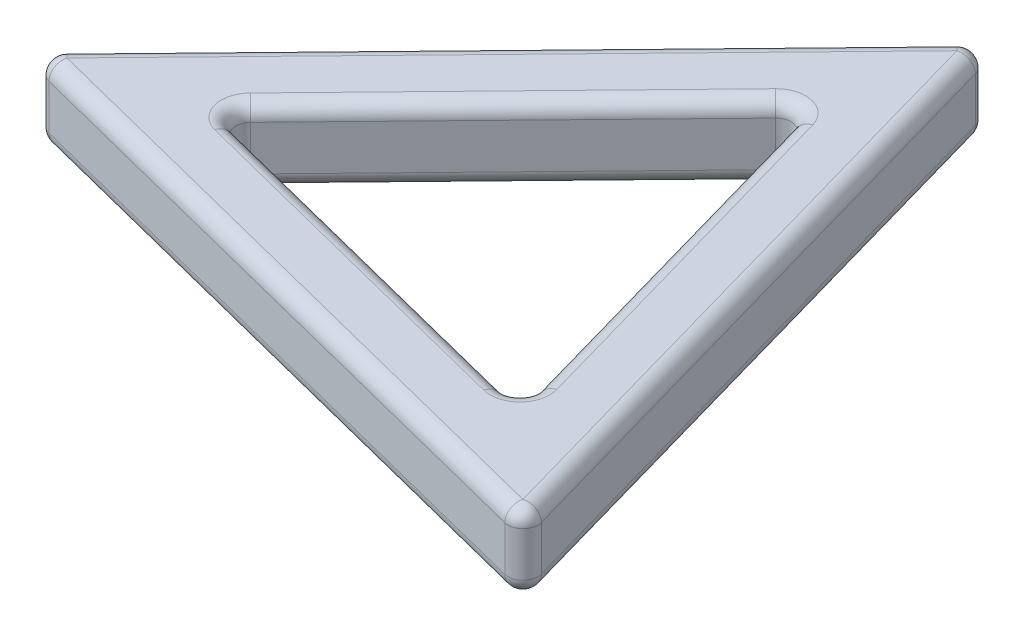
ISO-10303-21;
HEADER;
FILE_DESCRIPTION(('STEP AP214'),'2;1');
FILE_NAME('part.step','',(''),(''),'','','');
FILE_SCHEMA(('AUTOMOTIVE_DESIGN { 1 0 10303 214 1 1 1 1 }'));
ENDSEC;
DATA;
#1=APPLICATION_CONTEXT('core data for automotive mechanical design processes');
#2=APPLICATION_PROTOCOL_DEFINITION('international standard','automotive_design',2000,#1);
#3=PRODUCT_CONTEXT('',#1,'mechanical');
#4=PRODUCT('Part','Part','',(#3));
#5=PRODUCT_RELATED_PRODUCT_CATEGORY('part','',(#4));
#6=PRODUCT_DEFINITION_FORMATION('','',#4);
#7=PRODUCT_DEFINITION_CONTEXT('part definition',#1,'design');
#8=PRODUCT_DEFINITION('design','',#6,#7);
#9=PRODUCT_DEFINITION_SHAPE('','',#8);
#10=(LENGTH_UNIT() NAMED_UNIT(*) SI_UNIT(.MILLI.,.METRE.));
#11=(NAMED_UNIT(*) PLANE_ANGLE_UNIT() SI_UNIT($,.RADIAN.));
#12=(NAMED_UNIT(*) SI_UNIT($,.STERADIAN.) SOLID_ANGLE_UNIT());
#13=UNCERTAINTY_MEASURE_WITH_UNIT(LENGTH_MEASURE(1.E-05),#10,'distance_accuracy_value','');
#14=(GEOMETRIC_REPRESENTATION_CONTEXT(3) GLOBAL_UNCERTAINTY_ASSIGNED_CONTEXT((#13)) GLOBAL_UNIT_ASSIGNED_CONTEXT((#10,
#11,#12)) REPRESENTATION_CONTEXT('',''));
#15=CARTESIAN_POINT('',(0.,0.,0.));
#16=DIRECTION('',(0.,0.,1.));
#17=DIRECTION('',(1.,0.,0.));
#18=AXIS2_PLACEMENT_3D('',#15,#16,#17);
#19=CARTESIAN_POINT('',(37.8399876167163,10.,36.7800439859958));
#20=DIRECTION('',(0.,1.,0.));
#21=DIRECTION('',(0.,0.,1.));
#22=AXIS2_PLACEMENT_3D('',#19,#20,#21);
#23=PLANE('',#22);
#24=DIRECTION('',(-0.696992338556033,0.,0.717078573096556));
#25=VECTOR('',#24,1.);
#26=CARTESIAN_POINT('',(-49.3382891063465,10.,15.7743532390791));
#27=LINE('',#26,#25);
#28=CARTESIAN_POINT('',(11.9521634962858,10.,-47.2823948276063));
#29=VERTEX_POINT('',#28);
#30=CARTESIAN_POINT('',(-46.9238368206159,10.,13.2903201958346));
#31=VERTEX_POINT('',#30);
#32=EDGE_CURVE('E344',#29,#31,#27,.T.);
#33=ORIENTED_EDGE('',*,*,#32,.T.);
#34=DIRECTION('',(0.96950443008913,0.,0.24507378488437));
#35=VECTOR('',#34,1.);
#36=CARTESIAN_POINT('',(38.3301351864851,10.,34.8410351258175));
#37=LINE('',#36,#35);
#38=CARTESIAN_POINT('',(34.9716733243301,10.,33.9920746317716));
#39=VERTEX_POINT('',#38);
#40=EDGE_CURVE('E372',#31,#39,#37,.T.);
#41=ORIENTED_EDGE('',*,*,#40,.T.);
#42=DIRECTION('',(-0.272512091533098,0.,-0.962152357980926));
#43=VECTOR('',#42,1.);
#44=CARTESIAN_POINT('',(11.0081539198614,10.,-50.6153883648966));
#45=LINE('',#44,#43);
#46=EDGE_CURVE('E375',#39,#29,#45,.T.);
#47=ORIENTED_EDGE('',*,*,#46,.T.);
#48=EDGE_LOOP('',(#33,#41,#47));
#49=FACE_BOUND('',#48,.T.);
#50=CARTESIAN_POINT('',(20.630101862399,10.,20.052227860651));
#51=DIRECTION('',(0.,1.,0.));
#52=DIRECTION('',(0.,0.,1.));
#53=AXIS2_PLACEMENT_3D('',#50,#51,#52);
#54=CIRCLE('',#53,4.);
#55=CARTESIAN_POINT('',(19.6498067228615,10.,23.9302455810075));
#56=VERTEX_POINT('',#55);
#57=CARTESIAN_POINT('',(23.4984161547852,10.,22.8401972148751));
#58=VERTEX_POINT('',#57);
#59=EDGE_CURVE('E199',#56,#58,#54,.T.);
#60=ORIENTED_EDGE('',*,*,#59,.F.);
#61=DIRECTION('',(0.96950443008913,0.,0.24507378488437));
#62=VECTOR('',#61,1.);
#63=CARTESIAN_POINT('',(39.8005778957913,10.,29.0240085452827));
#64=LINE('',#63,#62);
#65=CARTESIAN_POINT('',(-28.6610848005348,10.,11.7180960855292));
#66=VERTEX_POINT('',#65);
#67=EDGE_CURVE('E215',#56,#66,#64,.F.);
#68=ORIENTED_EDGE('',*,*,#67,.T.);
#69=CARTESIAN_POINT('',(-27.6807896609974,10.,7.84007836517267));
#70=DIRECTION('',(0.,1.,0.));
#71=DIRECTION('',(0.,0.,1.));
#72=AXIS2_PLACEMENT_3D('',#69,#70,#71);
#73=CIRCLE('',#72,4.);
#74=CARTESIAN_POINT('',(-31.5293990929211,10.,8.93012673130507));
#75=VERTEX_POINT('',#74);
#76=EDGE_CURVE('E213',#75,#66,#73,.T.);
#77=ORIENTED_EDGE('',*,*,#76,.F.);
#78=CARTESIAN_POINT('',(-27.6807896609974,10.,7.84007836517267));
#79=DIRECTION('',(0.,1.,0.));
#80=DIRECTION('',(0.,0.,1.));
#81=AXIS2_PLACEMENT_3D('',#78,#79,#80);
#82=CIRCLE('',#81,4.);
#83=CARTESIAN_POINT('',(-30.5491039533836,10.,5.05210901094854));
#84=VERTEX_POINT('',#83);
#85=EDGE_CURVE('E206',#84,#75,#82,.T.);
#86=ORIENTED_EDGE('',*,*,#85,.F.);
#87=DIRECTION('',(-0.696992338556033,0.,0.717078573096556));
#88=VECTOR('',#87,1.);
#89=CARTESIAN_POINT('',(-13.1833652235857,10.,-12.8140832845497));
#90=LINE('',#89,#88);
#91=CARTESIAN_POINT('',(4.18237350621215,10.,-30.6802755800478));
#92=VERTEX_POINT('',#91);
#93=EDGE_CURVE('E385',#84,#92,#90,.F.);
#94=ORIENTED_EDGE('',*,*,#93,.T.);
#95=CARTESIAN_POINT('',(7.05068779859837,10.,-27.8923062258237));
#96=DIRECTION('',(0.,1.,0.));
#97=DIRECTION('',(0.,0.,1.));
#98=AXIS2_PLACEMENT_3D('',#95,#96,#97);
#99=CIRCLE('',#98,4.);
#100=CARTESIAN_POINT('',(8.03098293813586,10.,-31.7703239461802));
#101=VERTEX_POINT('',#100);
#102=EDGE_CURVE('E374',#101,#92,#99,.T.);
#103=ORIENTED_EDGE('',*,*,#102,.F.);
#104=CARTESIAN_POINT('',(7.05068779859837,10.,-27.8923062258237));
#105=DIRECTION('',(0.,1.,0.));
#106=DIRECTION('',(0.,0.,1.));
#107=AXIS2_PLACEMENT_3D('',#104,#105,#106);
#108=CIRCLE('',#107,4.);
#109=CARTESIAN_POINT('',(10.8992972305221,10.,-28.9823545919561));
#110=VERTEX_POINT('',#109);
#111=EDGE_CURVE('E378',#110,#101,#108,.T.);
#112=ORIENTED_EDGE('',*,*,#111,.F.);
#113=DIRECTION('',(-0.272512091533098,0.,-0.962152357980926));
#114=VECTOR('',#113,1.);
#115=CARTESIAN_POINT('',(30.1427687528689,10.,38.9601407182605));
#116=LINE('',#115,#114);
#117=CARTESIAN_POINT('',(24.4787112943227,10.,18.9621794945186));
#118=VERTEX_POINT('',#117);
#119=EDGE_CURVE('E202',#110,#118,#116,.F.);
#120=ORIENTED_EDGE('',*,*,#119,.T.);
#121=CARTESIAN_POINT('',(20.630101862399,10.,20.052227860651));
#122=DIRECTION('',(0.,1.,0.));
#123=DIRECTION('',(0.,0.,1.));
#124=AXIS2_PLACEMENT_3D('',#121,#122,#123);
#125=CIRCLE('',#124,4.);
#126=EDGE_CURVE('E196',#58,#118,#125,.T.);
#127=ORIENTED_EDGE('',*,*,#126,.F.);
#128=EDGE_LOOP('',(#60,#68,#77,#86,#94,#103,#112,#120,#127));
#129=FACE_BOUND('',#128,.T.);
#130=ADVANCED_FACE('F33',(#49,#129),#23,.T.);
#131=CARTESIAN_POINT('',(37.8399876167163,0.,36.7800439859958));
#132=DIRECTION('',(0.,1.,0.));
#133=DIRECTION('',(0.,0.,1.));
#134=AXIS2_PLACEMENT_3D('',#131,#132,#133);
#135=PLANE('',#134);
#136=DIRECTION('',(-0.272512091533098,0.,-0.962152357980926));
#137=VECTOR('',#136,1.);
#138=CARTESIAN_POINT('',(35.9156829007545,0.,37.325068169062));
#139=LINE('',#138,#137);
#140=CARTESIAN_POINT('',(11.9521634962858,0.,-47.2823948276063));
#141=VERTEX_POINT('',#140);
#142=CARTESIAN_POINT('',(34.9716733243301,0.,33.9920746317717));
#143=VERTEX_POINT('',#142);
#144=EDGE_CURVE('E463',#141,#143,#139,.F.);
#145=ORIENTED_EDGE('',*,*,#144,.T.);
#146=DIRECTION('',(0.96950443008913,0.,0.24507378488437));
#147=VECTOR('',#146,1.);
#148=CARTESIAN_POINT('',(38.3301351864851,0.,34.8410351258175));
#149=LINE('',#148,#147);
#150=CARTESIAN_POINT('',(-46.9238368206159,0.,13.2903201958346));
#151=VERTEX_POINT('',#150);
#152=EDGE_CURVE('E837',#143,#151,#149,.F.);
#153=ORIENTED_EDGE('',*,*,#152,.T.);
#154=DIRECTION('',(-0.696992338556033,0.,0.717078573096556));
#155=VECTOR('',#154,1.);
#156=CARTESIAN_POINT('',(-17.485836662165,0.,-16.9960373158859));
#157=LINE('',#156,#155);
#158=EDGE_CURVE('E290',#151,#141,#157,.F.);
#159=ORIENTED_EDGE('',*,*,#158,.T.);
#160=EDGE_LOOP('',(#145,#153,#159));
#161=FACE_BOUND('',#160,.T.);
#162=CARTESIAN_POINT('',(20.630101862399,0.,20.052227860651));
#163=DIRECTION('',(0.,1.,0.));
#164=DIRECTION('',(0.,0.,1.));
#165=AXIS2_PLACEMENT_3D('',#162,#163,#164);
#166=CIRCLE('',#165,4.);
#167=CARTESIAN_POINT('',(24.4787112943227,0.,18.9621794945186));
#168=VERTEX_POINT('',#167);
#169=CARTESIAN_POINT('',(23.4984161547852,0.,22.8401972148751));
#170=VERTEX_POINT('',#169);
#171=EDGE_CURVE('E420',#168,#170,#166,.F.);
#172=ORIENTED_EDGE('',*,*,#171,.F.);
#173=DIRECTION('',(-0.272512091533098,0.,-0.962152357980926));
#174=VECTOR('',#173,1.);
#175=CARTESIAN_POINT('',(9.95528765409771,0.,-32.3153481292464));
#176=LINE('',#175,#174);
#177=CARTESIAN_POINT('',(10.8992972305221,0.,-28.9823545919561));
#178=VERTEX_POINT('',#177);
#179=EDGE_CURVE('E809',#168,#178,#176,.T.);
#180=ORIENTED_EDGE('',*,*,#179,.T.);
#181=CARTESIAN_POINT('',(7.05068779859837,0.,-27.8923062258237));
#182=DIRECTION('',(0.,1.,0.));
#183=DIRECTION('',(0.,0.,1.));
#184=AXIS2_PLACEMENT_3D('',#181,#182,#183);
#185=CIRCLE('',#184,4.);
#186=CARTESIAN_POINT('',(8.03098293813586,0.,-31.7703239461802));
#187=VERTEX_POINT('',#186);
#188=EDGE_CURVE('E813',#187,#178,#185,.F.);
#189=ORIENTED_EDGE('',*,*,#188,.F.);
#190=CARTESIAN_POINT('',(7.05068779859837,0.,-27.8923062258237));
#191=DIRECTION('',(0.,1.,0.));
#192=DIRECTION('',(0.,0.,1.));
#193=AXIS2_PLACEMENT_3D('',#190,#191,#192);
#194=CIRCLE('',#193,4.);
#195=CARTESIAN_POINT('',(4.18237350621215,0.,-30.6802755800478));
#196=VERTEX_POINT('',#195);
#197=EDGE_CURVE('E814',#196,#187,#194,.F.);
#198=ORIENTED_EDGE('',*,*,#197,.F.);
#199=DIRECTION('',(-0.696992338556033,0.,0.717078573096556));
#200=VECTOR('',#199,1.);
#201=CARTESIAN_POINT('',(-32.9635562391142,0.,7.536142054193));
#202=LINE('',#201,#200);
#203=CARTESIAN_POINT('',(-30.5491039533836,0.,5.05210901094854));
#204=VERTEX_POINT('',#203);
#205=EDGE_CURVE('E819',#196,#204,#202,.T.);
#206=ORIENTED_EDGE('',*,*,#205,.T.);
#207=CARTESIAN_POINT('',(-27.6807896609974,0.,7.84007836517267));
#208=DIRECTION('',(0.,1.,0.));
#209=DIRECTION('',(0.,0.,1.));
#210=AXIS2_PLACEMENT_3D('',#207,#208,#209);
#211=CIRCLE('',#210,4.);
#212=CARTESIAN_POINT('',(-31.5293990929211,0.,8.93012673130507));
#213=VERTEX_POINT('',#212);
#214=EDGE_CURVE('E833',#213,#204,#211,.F.);
#215=ORIENTED_EDGE('',*,*,#214,.F.);
#216=CARTESIAN_POINT('',(-27.6807896609974,0.,7.84007836517267));
#217=DIRECTION('',(0.,1.,0.));
#218=DIRECTION('',(0.,0.,1.));
#219=AXIS2_PLACEMENT_3D('',#216,#217,#218);
#220=CIRCLE('',#219,4.);
#221=CARTESIAN_POINT('',(-28.6610848005348,0.,11.7180960855292));
#222=VERTEX_POINT('',#221);
#223=EDGE_CURVE('E812',#222,#213,#220,.F.);
#224=ORIENTED_EDGE('',*,*,#223,.F.);
#225=DIRECTION('',(0.96950443008913,0.,0.24507378488437));
#226=VECTOR('',#225,1.);
#227=CARTESIAN_POINT('',(23.0082685850165,0.,24.7792060750534));
#228=LINE('',#227,#226);
#229=CARTESIAN_POINT('',(19.6498067228615,0.,23.9302455810075));
#230=VERTEX_POINT('',#229);
#231=EDGE_CURVE('E810',#222,#230,#228,.T.);
#232=ORIENTED_EDGE('',*,*,#231,.T.);
#233=CARTESIAN_POINT('',(20.630101862399,0.,20.052227860651));
#234=DIRECTION('',(0.,1.,0.));
#235=DIRECTION('',(0.,0.,1.));
#236=AXIS2_PLACEMENT_3D('',#233,#234,#235);
#237=CIRCLE('',#236,4.);
#238=EDGE_CURVE('E425',#170,#230,#237,.F.);
#239=ORIENTED_EDGE('',*,*,#238,.F.);
#240=EDGE_LOOP('',(#172,#180,#189,#198,#206,#215,#224,#232,#239));
#241=FACE_BOUND('',#240,.T.);
#242=ADVANCED_FACE('F475',(#161,#241),#135,.F.);
#243=CARTESIAN_POINT('',(-50.7724462525396,10.,14.380368561967));
#244=DIRECTION('',(0.24507378488437,0.,-0.96950443008913));
#245=DIRECTION('',(-0.96950443008913,0.,-0.24507378488437));
#246=AXIS2_PLACEMENT_3D('',#243,#244,#245);
#247=PLANE('',#246);
#248=DIRECTION('',(0.96950443008913,0.,0.24507378488437));
#249=VECTOR('',#248,1.);
#250=CARTESIAN_POINT('',(-50.7724462525396,8.,14.380368561967));
#251=LINE('',#250,#249);
#252=CARTESIAN_POINT('',(34.4815257545614,8.,35.9310834919499));
#253=VERTEX_POINT('',#252);
#254=CARTESIAN_POINT('',(-47.4139843903846,8.,15.2293290560129));
#255=VERTEX_POINT('',#254);
#256=EDGE_CURVE('E222',#253,#255,#251,.F.);
#257=ORIENTED_EDGE('',*,*,#256,.T.);
#258=DIRECTION('',(0.,-1.,0.));
#259=VECTOR('',#258,1.);
#260=CARTESIAN_POINT('',(-47.4139843903846,10.,15.2293290560129));
#261=LINE('',#260,#259);
#262=CARTESIAN_POINT('',(-47.4139843903846,2.,15.2293290560129));
#263=VERTEX_POINT('',#262);
#264=EDGE_CURVE('E227',#255,#263,#261,.T.);
#265=ORIENTED_EDGE('',*,*,#264,.T.);
#266=DIRECTION('',(0.96950443008913,0.,0.24507378488437));
#267=VECTOR('',#266,1.);
#268=CARTESIAN_POINT('',(-50.7724462525396,2.,14.380368561967));
#269=LINE('',#268,#267);
#270=CARTESIAN_POINT('',(34.4815257545614,2.,35.9310834919499));
#271=VERTEX_POINT('',#270);
#272=EDGE_CURVE('E224',#263,#271,#269,.T.);
#273=ORIENTED_EDGE('',*,*,#272,.T.);
#274=DIRECTION('',(0.,-1.,0.));
#275=VECTOR('',#274,1.);
#276=CARTESIAN_POINT('',(34.4815257545614,10.,35.9310834919499));
#277=LINE('',#276,#275);
#278=EDGE_CURVE('E220',#271,#253,#277,.F.);
#279=ORIENTED_EDGE('',*,*,#278,.T.);
#280=EDGE_LOOP('',(#257,#265,#273,#279));
#281=FACE_BOUND('',#280,.T.);
#282=ADVANCED_FACE('F480',(#281),#247,.F.);
#283=CARTESIAN_POINT('',(37.8399876167163,10.,36.7800439859958));
#284=DIRECTION('',(-0.962152357980926,0.,0.272512091533098));
#285=DIRECTION('',(0.272512091533098,0.,0.962152357980926));
#286=AXIS2_PLACEMENT_3D('',#283,#284,#285);
#287=PLANE('',#286);
#288=DIRECTION('',(-0.272512091533098,0.,-0.962152357980926));
#289=VECTOR('',#288,1.);
#290=CARTESIAN_POINT('',(37.8399876167163,2.,36.7800439859958));
#291=LINE('',#290,#289);
#292=CARTESIAN_POINT('',(36.895978040292,2.,33.4470504487055));
#293=VERTEX_POINT('',#292);
#294=CARTESIAN_POINT('',(13.8764682122476,2.,-47.8274190106725));
#295=VERTEX_POINT('',#294);
#296=EDGE_CURVE('E233',#293,#295,#291,.T.);
#297=ORIENTED_EDGE('',*,*,#296,.T.);
#298=DIRECTION('',(0.,-1.,0.));
#299=VECTOR('',#298,1.);
#300=CARTESIAN_POINT('',(13.8764682122476,10.,-47.8274190106725));
#301=LINE('',#300,#299);
#302=CARTESIAN_POINT('',(13.8764682122476,8.,-47.8274190106725));
#303=VERTEX_POINT('',#302);
#304=EDGE_CURVE('E236',#295,#303,#301,.F.);
#305=ORIENTED_EDGE('',*,*,#304,.T.);
#306=DIRECTION('',(-0.272512091533098,0.,-0.962152357980926));
#307=VECTOR('',#306,1.);
#308=CARTESIAN_POINT('',(37.8399876167163,8.,36.7800439859958));
#309=LINE('',#308,#307);
#310=CARTESIAN_POINT('',(36.895978040292,8.,33.4470504487055));
#311=VERTEX_POINT('',#310);
#312=EDGE_CURVE('E231',#303,#311,#309,.F.);
#313=ORIENTED_EDGE('',*,*,#312,.T.);
#314=DIRECTION('',(0.,-1.,0.));
#315=VECTOR('',#314,1.);
#316=CARTESIAN_POINT('',(36.895978040292,10.,33.4470504487055));
#317=LINE('',#316,#315);
#318=EDGE_CURVE('E229',#311,#293,#317,.T.);
#319=ORIENTED_EDGE('',*,*,#318,.T.);
#320=EDGE_LOOP('',(#297,#305,#313,#319));
#321=FACE_BOUND('',#320,.T.);
#322=ADVANCED_FACE('F457',(#321),#287,.F.);
#323=CARTESIAN_POINT('',(12.9324586358233,10.,-51.1604125479628));
#324=DIRECTION('',(0.717078573096556,0.,0.696992338556033));
#325=DIRECTION('',(0.696992338556033,0.,-0.717078573096556));
#326=AXIS2_PLACEMENT_3D('',#323,#324,#325);
#327=PLANE('',#326);
#328=DIRECTION('',(-0.696992338556033,0.,0.717078573096556));
#329=VECTOR('',#328,1.);
#330=CARTESIAN_POINT('',(12.9324586358233,2.,-51.1604125479628));
#331=LINE('',#330,#329);
#332=CARTESIAN_POINT('',(10.5180063500927,2.,-48.6763795047183));
#333=VERTEX_POINT('',#332);
#334=CARTESIAN_POINT('',(-48.357993966809,2.,11.8963355187226));
#335=VERTEX_POINT('',#334);
#336=EDGE_CURVE('E42',#333,#335,#331,.T.);
#337=ORIENTED_EDGE('',*,*,#336,.T.);
#338=DIRECTION('',(0.,-1.,0.));
#339=VECTOR('',#338,1.);
#340=CARTESIAN_POINT('',(-48.357993966809,10.,11.8963355187226));
#341=LINE('',#340,#339);
#342=CARTESIAN_POINT('',(-48.357993966809,8.,11.8963355187226));
#343=VERTEX_POINT('',#342);
#344=EDGE_CURVE('E11',#335,#343,#341,.F.);
#345=ORIENTED_EDGE('',*,*,#344,.T.);
#346=DIRECTION('',(-0.696992338556033,0.,0.717078573096556));
#347=VECTOR('',#346,1.);
#348=CARTESIAN_POINT('',(12.9324586358233,8.,-51.1604125479628));
#349=LINE('',#348,#347);
#350=CARTESIAN_POINT('',(10.5180063500927,8.,-48.6763795047183));
#351=VERTEX_POINT('',#350);
#352=EDGE_CURVE('E240',#343,#351,#349,.F.);
#353=ORIENTED_EDGE('',*,*,#352,.T.);
#354=DIRECTION('',(0.,-1.,0.));
#355=VECTOR('',#354,1.);
#356=CARTESIAN_POINT('',(10.5180063500927,10.,-48.6763795047183));
#357=LINE('',#356,#355);
#358=EDGE_CURVE('E238',#351,#333,#357,.T.);
#359=ORIENTED_EDGE('',*,*,#358,.T.);
#360=EDGE_LOOP('',(#337,#345,#353,#359));
#361=FACE_BOUND('',#360,.T.);
#362=ADVANCED_FACE('F352',(#361),#327,.F.);
#363=CARTESIAN_POINT('',(-31.5293990929211,10.,8.93012673130507));
#364=DIRECTION('',(0.24507378488437,0.,-0.96950443008913));
#365=DIRECTION('',(-0.96950443008913,0.,-0.24507378488437));
#366=AXIS2_PLACEMENT_3D('',#363,#364,#365);
#367=PLANE('',#366);
#368=DIRECTION('',(0.96950443008913,0.,0.24507378488437));
#369=VECTOR('',#368,1.);
#370=CARTESIAN_POINT('',(-31.5293990929211,2.,8.93012673130507));
#371=LINE('',#370,#369);
#372=CARTESIAN_POINT('',(20.1399542926302,2.,21.9912367208293));
#373=VERTEX_POINT('',#372);
#374=CARTESIAN_POINT('',(-28.1709372307661,2.,9.77908722535094));
#375=VERTEX_POINT('',#374);
#376=EDGE_CURVE('E422',#373,#375,#371,.F.);
#377=ORIENTED_EDGE('',*,*,#376,.T.);
#378=DIRECTION('',(0.,-1.,0.));
#379=VECTOR('',#378,1.);
#380=CARTESIAN_POINT('',(-28.1709372307661,10.,9.77908722535094));
#381=LINE('',#380,#379);
#382=CARTESIAN_POINT('',(-28.1709372307661,8.,9.77908722535094));
#383=VERTEX_POINT('',#382);
#384=EDGE_CURVE('E430',#375,#383,#381,.F.);
#385=ORIENTED_EDGE('',*,*,#384,.T.);
#386=DIRECTION('',(0.96950443008913,0.,0.24507378488437));
#387=VECTOR('',#386,1.);
#388=CARTESIAN_POINT('',(-31.5293990929211,8.,8.93012673130507));
#389=LINE('',#388,#387);
#390=CARTESIAN_POINT('',(20.1399542926302,8.,21.9912367208293));
#391=VERTEX_POINT('',#390);
#392=EDGE_CURVE('E419',#383,#391,#389,.T.);
#393=ORIENTED_EDGE('',*,*,#392,.T.);
#394=DIRECTION('',(0.,-1.,0.));
#395=VECTOR('',#394,1.);
#396=CARTESIAN_POINT('',(20.1399542926302,0.,21.9912367208293));
#397=LINE('',#396,#395);
#398=EDGE_CURVE('E415',#391,#373,#397,.T.);
#399=ORIENTED_EDGE('',*,*,#398,.T.);
#400=EDGE_LOOP('',(#377,#385,#393,#399));
#401=FACE_BOUND('',#400,.T.);
#402=ADVANCED_FACE('F484',(#401),#367,.T.);
#403=CARTESIAN_POINT('',(23.4984161547852,10.,22.8401972148751));
#404=DIRECTION('',(-0.962152357980926,0.,0.272512091533098));
#405=DIRECTION('',(0.272512091533098,0.,0.962152357980926));
#406=AXIS2_PLACEMENT_3D('',#403,#404,#405);
#407=PLANE('',#406);
#408=DIRECTION('',(-0.272512091533098,0.,-0.962152357980926));
#409=VECTOR('',#408,1.);
#410=CARTESIAN_POINT('',(23.4984161547852,8.,22.8401972148751));
#411=LINE('',#410,#409);
#412=CARTESIAN_POINT('',(22.5544065783608,8.,19.5072036775848));
#413=VERTEX_POINT('',#412);
#414=CARTESIAN_POINT('',(8.97499251456023,8.,-28.4373304088899));
#415=VERTEX_POINT('',#414);
#416=EDGE_CURVE('E407',#413,#415,#411,.T.);
#417=ORIENTED_EDGE('',*,*,#416,.T.);
#418=DIRECTION('',(0.,-1.,0.));
#419=VECTOR('',#418,1.);
#420=CARTESIAN_POINT('',(8.97499251456023,0.,-28.4373304088899));
#421=LINE('',#420,#419);
#422=CARTESIAN_POINT('',(8.97499251456023,2.,-28.4373304088899));
#423=VERTEX_POINT('',#422);
#424=EDGE_CURVE('E436',#415,#423,#421,.T.);
#425=ORIENTED_EDGE('',*,*,#424,.T.);
#426=DIRECTION('',(-0.272512091533098,0.,-0.962152357980926));
#427=VECTOR('',#426,1.);
#428=CARTESIAN_POINT('',(23.4984161547852,2.,22.8401972148751));
#429=LINE('',#428,#427);
#430=CARTESIAN_POINT('',(22.5544065783608,2.,19.5072036775848));
#431=VERTEX_POINT('',#430);
#432=EDGE_CURVE('E434',#423,#431,#429,.F.);
#433=ORIENTED_EDGE('',*,*,#432,.T.);
#434=DIRECTION('',(0.,-1.,0.));
#435=VECTOR('',#434,1.);
#436=CARTESIAN_POINT('',(22.5544065783608,10.,19.5072036775848));
#437=LINE('',#436,#435);
#438=EDGE_CURVE('E413',#431,#413,#437,.F.);
#439=ORIENTED_EDGE('',*,*,#438,.T.);
#440=EDGE_LOOP('',(#417,#425,#433,#439));
#441=FACE_BOUND('',#440,.T.);
#442=ADVANCED_FACE('F741',(#441),#407,.T.);
#443=CARTESIAN_POINT('',(8.03098293813586,10.,-31.7703239461802));
#444=DIRECTION('',(0.717078573096556,0.,0.696992338556033));
#445=DIRECTION('',(0.696992338556033,0.,-0.717078573096556));
#446=AXIS2_PLACEMENT_3D('',#443,#444,#445);
#447=PLANE('',#446);
#448=DIRECTION('',(-0.696992338556033,0.,0.717078573096556));
#449=VECTOR('',#448,1.);
#450=CARTESIAN_POINT('',(8.03098293813586,8.,-31.7703239461802));
#451=LINE('',#450,#449);
#452=CARTESIAN_POINT('',(5.61653065240526,8.,-29.2862909029358));
#453=VERTEX_POINT('',#452);
#454=CARTESIAN_POINT('',(-29.1149468071905,8.,6.44609368806061));
#455=VERTEX_POINT('',#454);
#456=EDGE_CURVE('E398',#453,#455,#451,.T.);
#457=ORIENTED_EDGE('',*,*,#456,.T.);
#458=DIRECTION('',(0.,-1.,0.));
#459=VECTOR('',#458,1.);
#460=CARTESIAN_POINT('',(-29.1149468071905,0.,6.44609368806061));
#461=LINE('',#460,#459);
#462=CARTESIAN_POINT('',(-29.1149468071905,2.,6.44609368806061));
#463=VERTEX_POINT('',#462);
#464=EDGE_CURVE('E444',#455,#463,#461,.T.);
#465=ORIENTED_EDGE('',*,*,#464,.T.);
#466=DIRECTION('',(-0.696992338556033,0.,0.717078573096556));
#467=VECTOR('',#466,1.);
#468=CARTESIAN_POINT('',(8.03098293813586,2.,-31.7703239461802));
#469=LINE('',#468,#467);
#470=CARTESIAN_POINT('',(5.61653065240526,2.,-29.2862909029358));
#471=VERTEX_POINT('',#470);
#472=EDGE_CURVE('E441',#463,#471,#469,.F.);
#473=ORIENTED_EDGE('',*,*,#472,.T.);
#474=DIRECTION('',(0.,-1.,0.));
#475=VECTOR('',#474,1.);
#476=CARTESIAN_POINT('',(5.61653065240526,10.,-29.2862909029358));
#477=LINE('',#476,#475);
#478=EDGE_CURVE('E438',#471,#453,#477,.F.);
#479=ORIENTED_EDGE('',*,*,#478,.T.);
#480=EDGE_LOOP('',(#457,#465,#473,#479));
#481=FACE_BOUND('',#480,.T.);
#482=ADVANCED_FACE('F542',(#481),#447,.T.);
#483=CARTESIAN_POINT('',(7.05068779859837,8.,-27.8923062258237));
#484=DIRECTION('',(0.,1.,0.));
#485=DIRECTION('',(0.,0.,1.));
#486=AXIS2_PLACEMENT_3D('',#483,#484,#485);
#487=TOROIDAL_SURFACE('',#486,4.,2.);
#488=ORIENTED_EDGE('',*,*,#111,.T.);
#489=ORIENTED_EDGE('',*,*,#102,.T.);
#490=CARTESIAN_POINT('',(4.18237350621215,8.,-30.6802755800478));
#491=DIRECTION('',(0.696992338556032,0.,-0.717078573096556));
#492=DIRECTION('',(-0.717078573096556,0.,-0.696992338556032));
#493=AXIS2_PLACEMENT_3D('',#490,#491,#492);
#494=CIRCLE('',#493,2.);
#495=EDGE_CURVE('E287',#453,#92,#494,.F.);
#496=ORIENTED_EDGE('',*,*,#495,.F.);
#497=CARTESIAN_POINT('',(7.05068779859837,8.,-27.8923062258237));
#498=DIRECTION('',(0.,1.,0.));
#499=DIRECTION('',(0.,0.,1.));
#500=AXIS2_PLACEMENT_3D('',#497,#498,#499);
#501=CIRCLE('',#500,2.);
#502=EDGE_CURVE('E284',#415,#453,#501,.T.);
#503=ORIENTED_EDGE('',*,*,#502,.F.);
#504=CARTESIAN_POINT('',(10.8992972305221,8.,-28.9823545919561));
#505=DIRECTION('',(-0.272512091533098,0.,-0.962152357980926));
#506=DIRECTION('',(-0.962152357980926,0.,0.272512091533098));
#507=AXIS2_PLACEMENT_3D('',#504,#505,#506);
#508=CIRCLE('',#507,2.);
#509=EDGE_CURVE('E281',#110,#415,#508,.F.);
#510=ORIENTED_EDGE('',*,*,#509,.F.);
#511=EDGE_LOOP('',(#488,#489,#496,#503,#510));
#512=FACE_BOUND('',#511,.T.);
#513=ADVANCED_FACE('F401',(#512),#487,.T.);
#514=CARTESIAN_POINT('',(6.59682579194274,8.,-33.1643086232923));
#515=DIRECTION('',(-0.696992338556033,0.,0.717078573096556));
#516=DIRECTION('',(0.717078573096556,0.,0.696992338556033));
#517=AXIS2_PLACEMENT_3D('',#514,#515,#516);
#518=CYLINDRICAL_SURFACE('',#517,2.);
#519=ORIENTED_EDGE('',*,*,#495,.T.);
#520=ORIENTED_EDGE('',*,*,#93,.F.);
#521=CARTESIAN_POINT('',(-30.5491039533836,8.,5.05210901094854));
#522=DIRECTION('',(-0.696992338556033,0.,0.717078573096556));
#523=DIRECTION('',(0.717078573096556,0.,0.696992338556033));
#524=AXIS2_PLACEMENT_3D('',#521,#522,#523);
#525=CIRCLE('',#524,2.);
#526=EDGE_CURVE('E275',#455,#84,#525,.T.);
#527=ORIENTED_EDGE('',*,*,#526,.F.);
#528=ORIENTED_EDGE('',*,*,#456,.F.);
#529=EDGE_LOOP('',(#519,#520,#527,#528));
#530=FACE_BOUND('',#529,.T.);
#531=ADVANCED_FACE('F395',(#530),#518,.T.);
#532=CARTESIAN_POINT('',(7.05068779859837,10.,-27.8923062258237));
#533=DIRECTION('',(0.,1.,0.));
#534=DIRECTION('',(0.,0.,1.));
#535=AXIS2_PLACEMENT_3D('',#532,#533,#534);
#536=CYLINDRICAL_SURFACE('',#535,2.);
#537=ORIENTED_EDGE('',*,*,#502,.T.);
#538=ORIENTED_EDGE('',*,*,#478,.F.);
#539=CARTESIAN_POINT('',(7.05068779859837,2.,-27.8923062258237));
#540=DIRECTION('',(0.,1.,0.));
#541=DIRECTION('',(0.,0.,1.));
#542=AXIS2_PLACEMENT_3D('',#539,#540,#541);
#543=CIRCLE('',#542,2.);
#544=EDGE_CURVE('E272',#423,#471,#543,.T.);
#545=ORIENTED_EDGE('',*,*,#544,.F.);
#546=ORIENTED_EDGE('',*,*,#424,.F.);
#547=EDGE_LOOP('',(#537,#538,#545,#546));
#548=FACE_BOUND('',#547,.T.);
#549=ADVANCED_FACE('F534',(#548),#536,.F.);
#550=CARTESIAN_POINT('',(25.4227208707471,8.,22.2951730318089));
#551=DIRECTION('',(-0.272512091533098,0.,-0.962152357980926));
#552=DIRECTION('',(-0.962152357980926,0.,0.272512091533098));
#553=AXIS2_PLACEMENT_3D('',#550,#551,#552);
#554=CYLINDRICAL_SURFACE('',#553,2.);
#555=ORIENTED_EDGE('',*,*,#509,.T.);
#556=ORIENTED_EDGE('',*,*,#416,.F.);
#557=CARTESIAN_POINT('',(24.4787112943227,8.,18.9621794945186));
#558=DIRECTION('',(0.272512091533098,0.,0.962152357980926));
#559=DIRECTION('',(0.962152357980926,0.,-0.272512091533098));
#560=AXIS2_PLACEMENT_3D('',#557,#558,#559);
#561=CIRCLE('',#560,2.);
#562=EDGE_CURVE('E270',#118,#413,#561,.T.);
#563=ORIENTED_EDGE('',*,*,#562,.F.);
#564=ORIENTED_EDGE('',*,*,#119,.F.);
#565=EDGE_LOOP('',(#555,#556,#563,#564));
#566=FACE_BOUND('',#565,.T.);
#567=ADVANCED_FACE('F406',(#566),#554,.T.);
#568=CARTESIAN_POINT('',(-32.0195466626898,8.,10.8691355914833));
#569=DIRECTION('',(0.96950443008913,0.,0.24507378488437));
#570=DIRECTION('',(0.24507378488437,0.,-0.96950443008913));
#571=AXIS2_PLACEMENT_3D('',#568,#569,#570);
#572=CYLINDRICAL_SURFACE('',#571,2.);
#573=CARTESIAN_POINT('',(-28.6610848005348,8.,11.7180960855292));
#574=DIRECTION('',(-0.969504430089131,0.,-0.245073784884369));
#575=DIRECTION('',(-0.245073784884369,0.,0.969504430089131));
#576=AXIS2_PLACEMENT_3D('',#573,#574,#575);
#577=CIRCLE('',#576,2.);
#578=EDGE_CURVE('E278',#66,#383,#577,.T.);
#579=ORIENTED_EDGE('',*,*,#578,.F.);
#580=ORIENTED_EDGE('',*,*,#67,.F.);
#581=CARTESIAN_POINT('',(19.6498067228615,8.,23.9302455810075));
#582=DIRECTION('',(0.96950443008913,0.,0.245073784884369));
#583=DIRECTION('',(0.24507378488437,0.,-0.969504430089131));
#584=AXIS2_PLACEMENT_3D('',#581,#582,#583);
#585=CIRCLE('',#584,2.);
#586=EDGE_CURVE('E212',#391,#56,#585,.T.);
#587=ORIENTED_EDGE('',*,*,#586,.F.);
#588=ORIENTED_EDGE('',*,*,#392,.F.);
#589=EDGE_LOOP('',(#579,#580,#587,#588));
#590=FACE_BOUND('',#589,.T.);
#591=ADVANCED_FACE('F528',(#590),#572,.T.);
#592=CARTESIAN_POINT('',(-27.6807896609974,8.,7.84007836517267));
#593=DIRECTION('',(0.,1.,0.));
#594=DIRECTION('',(0.,0.,1.));
#595=AXIS2_PLACEMENT_3D('',#592,#593,#594);
#596=TOROIDAL_SURFACE('',#595,4.,2.);
#597=ORIENTED_EDGE('',*,*,#76,.T.);
#598=ORIENTED_EDGE('',*,*,#578,.T.);
#599=CARTESIAN_POINT('',(-27.6807896609974,8.,7.84007836517267));
#600=DIRECTION('',(0.,1.,0.));
#601=DIRECTION('',(0.,0.,1.));
#602=AXIS2_PLACEMENT_3D('',#599,#600,#601);
#603=CIRCLE('',#602,2.);
#604=EDGE_CURVE('E266',#455,#383,#603,.T.);
#605=ORIENTED_EDGE('',*,*,#604,.F.);
#606=ORIENTED_EDGE('',*,*,#526,.T.);
#607=ORIENTED_EDGE('',*,*,#85,.T.);
#608=EDGE_LOOP('',(#597,#598,#605,#606,#607));
#609=FACE_BOUND('',#608,.T.);
#610=ADVANCED_FACE('F389',(#609),#596,.T.);
#611=CARTESIAN_POINT('',(7.05068779859837,2.,-27.8923062258237));
#612=DIRECTION('',(0.,1.,0.));
#613=DIRECTION('',(0.,0.,1.));
#614=AXIS2_PLACEMENT_3D('',#611,#612,#613);
#615=TOROIDAL_SURFACE('',#614,4.,2.);
#616=CARTESIAN_POINT('',(10.8992972305221,2.,-28.9823545919561));
#617=DIRECTION('',(-0.272512091533098,0.,-0.962152357980926));
#618=DIRECTION('',(-0.962152357980926,0.,0.272512091533098));
#619=AXIS2_PLACEMENT_3D('',#616,#617,#618);
#620=CIRCLE('',#619,2.);
#621=EDGE_CURVE('E261',#423,#178,#620,.F.);
#622=ORIENTED_EDGE('',*,*,#621,.F.);
#623=ORIENTED_EDGE('',*,*,#544,.T.);
#624=CARTESIAN_POINT('',(4.18237350621215,2.,-30.6802755800478));
#625=DIRECTION('',(0.696992338556033,0.,-0.717078573096556));
#626=DIRECTION('',(-0.717078573096556,0.,-0.696992338556033));
#627=AXIS2_PLACEMENT_3D('',#624,#625,#626);
#628=CIRCLE('',#627,2.);
#629=EDGE_CURVE('E264',#196,#471,#628,.F.);
#630=ORIENTED_EDGE('',*,*,#629,.F.);
#631=ORIENTED_EDGE('',*,*,#197,.T.);
#632=ORIENTED_EDGE('',*,*,#188,.T.);
#633=EDGE_LOOP('',(#622,#623,#630,#631,#632));
#634=FACE_BOUND('',#633,.T.);
#635=ADVANCED_FACE('F522',(#634),#615,.T.);
#636=CARTESIAN_POINT('',(20.630101862399,8.,20.052227860651));
#637=DIRECTION('',(0.,1.,0.));
#638=DIRECTION('',(0.,0.,1.));
#639=AXIS2_PLACEMENT_3D('',#636,#637,#638);
#640=TOROIDAL_SURFACE('',#639,4.,2.);
#641=ORIENTED_EDGE('',*,*,#126,.T.);
#642=ORIENTED_EDGE('',*,*,#562,.T.);
#643=CARTESIAN_POINT('',(20.630101862399,8.,20.052227860651));
#644=DIRECTION('',(0.,1.,0.));
#645=DIRECTION('',(0.,0.,1.));
#646=AXIS2_PLACEMENT_3D('',#643,#644,#645);
#647=CIRCLE('',#646,2.);
#648=EDGE_CURVE('E258',#391,#413,#647,.T.);
#649=ORIENTED_EDGE('',*,*,#648,.F.);
#650=ORIENTED_EDGE('',*,*,#586,.T.);
#651=ORIENTED_EDGE('',*,*,#59,.T.);
#652=EDGE_LOOP('',(#641,#642,#649,#650,#651));
#653=FACE_BOUND('',#652,.T.);
#654=ADVANCED_FACE('F209',(#653),#640,.T.);
#655=CARTESIAN_POINT('',(-27.6807896609974,10.,7.84007836517267));
#656=DIRECTION('',(0.,1.,0.));
#657=DIRECTION('',(0.,0.,1.));
#658=AXIS2_PLACEMENT_3D('',#655,#656,#657);
#659=CYLINDRICAL_SURFACE('',#658,2.);
#660=ORIENTED_EDGE('',*,*,#604,.T.);
#661=ORIENTED_EDGE('',*,*,#384,.F.);
#662=CARTESIAN_POINT('',(-27.6807896609974,2.,7.84007836517267));
#663=DIRECTION('',(0.,1.,0.));
#664=DIRECTION('',(0.,0.,1.));
#665=AXIS2_PLACEMENT_3D('',#662,#663,#664);
#666=CIRCLE('',#665,2.);
#667=EDGE_CURVE('E255',#463,#375,#666,.T.);
#668=ORIENTED_EDGE('',*,*,#667,.F.);
#669=ORIENTED_EDGE('',*,*,#464,.F.);
#670=EDGE_LOOP('',(#660,#661,#668,#669));
#671=FACE_BOUND('',#670,.T.);
#672=ADVANCED_FACE('F515',(#671),#659,.F.);
#673=CARTESIAN_POINT('',(-13.1833652235857,2.,-12.8140832845497));
#674=DIRECTION('',(0.696992338556033,0.,-0.717078573096556));
#675=DIRECTION('',(-0.717078573096556,0.,-0.696992338556033));
#676=AXIS2_PLACEMENT_3D('',#673,#674,#675);
#677=CYLINDRICAL_SURFACE('',#676,2.);
#678=ORIENTED_EDGE('',*,*,#629,.T.);
#679=ORIENTED_EDGE('',*,*,#472,.F.);
#680=CARTESIAN_POINT('',(-30.5491039533836,2.,5.05210901094854));
#681=DIRECTION('',(-0.696992338556033,0.,0.717078573096556));
#682=DIRECTION('',(0.717078573096556,0.,0.696992338556033));
#683=AXIS2_PLACEMENT_3D('',#680,#681,#682);
#684=CIRCLE('',#683,2.);
#685=EDGE_CURVE('E252',#204,#463,#684,.T.);
#686=ORIENTED_EDGE('',*,*,#685,.F.);
#687=ORIENTED_EDGE('',*,*,#205,.F.);
#688=EDGE_LOOP('',(#678,#679,#686,#687));
#689=FACE_BOUND('',#688,.T.);
#690=ADVANCED_FACE('F511',(#689),#677,.T.);
#691=CARTESIAN_POINT('',(30.1427687528689,2.,38.9601407182605));
#692=DIRECTION('',(0.272512091533098,0.,0.962152357980926));
#693=DIRECTION('',(0.962152357980926,0.,-0.272512091533098));
#694=AXIS2_PLACEMENT_3D('',#691,#692,#693);
#695=CYLINDRICAL_SURFACE('',#694,2.);
#696=ORIENTED_EDGE('',*,*,#621,.T.);
#697=ORIENTED_EDGE('',*,*,#179,.F.);
#698=CARTESIAN_POINT('',(24.4787112943227,2.,18.9621794945186));
#699=DIRECTION('',(0.272512091533098,0.,0.962152357980926));
#700=DIRECTION('',(0.962152357980926,0.,-0.272512091533098));
#701=AXIS2_PLACEMENT_3D('',#698,#699,#700);
#702=CIRCLE('',#701,2.);
#703=EDGE_CURVE('E249',#431,#168,#702,.T.);
#704=ORIENTED_EDGE('',*,*,#703,.F.);
#705=ORIENTED_EDGE('',*,*,#432,.F.);
#706=EDGE_LOOP('',(#696,#697,#704,#705));
#707=FACE_BOUND('',#706,.T.);
#708=ADVANCED_FACE('F508',(#707),#695,.T.);
#709=CARTESIAN_POINT('',(20.630101862399,10.,20.052227860651));
#710=DIRECTION('',(0.,1.,0.));
#711=DIRECTION('',(0.,0.,1.));
#712=AXIS2_PLACEMENT_3D('',#709,#710,#711);
#713=CYLINDRICAL_SURFACE('',#712,2.);
#714=ORIENTED_EDGE('',*,*,#648,.T.);
#715=ORIENTED_EDGE('',*,*,#438,.F.);
#716=CARTESIAN_POINT('',(20.630101862399,2.,20.052227860651));
#717=DIRECTION('',(0.,1.,0.));
#718=DIRECTION('',(0.,0.,1.));
#719=AXIS2_PLACEMENT_3D('',#716,#717,#718);
#720=CIRCLE('',#719,2.);
#721=EDGE_CURVE('E247',#373,#431,#720,.T.);
#722=ORIENTED_EDGE('',*,*,#721,.F.);
#723=ORIENTED_EDGE('',*,*,#398,.F.);
#724=EDGE_LOOP('',(#714,#715,#722,#723));
#725=FACE_BOUND('',#724,.T.);
#726=ADVANCED_FACE('F411',(#725),#713,.F.);
#727=CARTESIAN_POINT('',(-27.6807896609974,2.,7.84007836517267));
#728=DIRECTION('',(0.,1.,0.));
#729=DIRECTION('',(0.,0.,1.));
#730=AXIS2_PLACEMENT_3D('',#727,#728,#729);
#731=TOROIDAL_SURFACE('',#730,4.,2.);
#732=ORIENTED_EDGE('',*,*,#685,.T.);
#733=ORIENTED_EDGE('',*,*,#667,.T.);
#734=CARTESIAN_POINT('',(-28.6610848005348,2.,11.7180960855292));
#735=DIRECTION('',(-0.96950443008913,0.,-0.245073784884369));
#736=DIRECTION('',(-0.24507378488437,0.,0.969504430089131));
#737=AXIS2_PLACEMENT_3D('',#734,#735,#736);
#738=CIRCLE('',#737,2.);
#739=EDGE_CURVE('E245',#222,#375,#738,.F.);
#740=ORIENTED_EDGE('',*,*,#739,.F.);
#741=ORIENTED_EDGE('',*,*,#223,.T.);
#742=ORIENTED_EDGE('',*,*,#214,.T.);
#743=EDGE_LOOP('',(#732,#733,#740,#741,#742));
#744=FACE_BOUND('',#743,.T.);
#745=ADVANCED_FACE('F501',(#744),#731,.T.);
#746=CARTESIAN_POINT('',(20.630101862399,2.,20.052227860651));
#747=DIRECTION('',(0.,1.,0.));
#748=DIRECTION('',(0.,0.,1.));
#749=AXIS2_PLACEMENT_3D('',#746,#747,#748);
#750=TOROIDAL_SURFACE('',#749,4.,2.);
#751=ORIENTED_EDGE('',*,*,#171,.T.);
#752=ORIENTED_EDGE('',*,*,#238,.T.);
#753=CARTESIAN_POINT('',(19.6498067228615,2.,23.9302455810075));
#754=DIRECTION('',(0.969504430089131,0.,0.245073784884369));
#755=DIRECTION('',(0.245073784884369,0.,-0.969504430089131));
#756=AXIS2_PLACEMENT_3D('',#753,#754,#755);
#757=CIRCLE('',#756,2.);
#758=EDGE_CURVE('E243',#373,#230,#757,.F.);
#759=ORIENTED_EDGE('',*,*,#758,.F.);
#760=ORIENTED_EDGE('',*,*,#721,.T.);
#761=ORIENTED_EDGE('',*,*,#703,.T.);
#762=EDGE_LOOP('',(#751,#752,#759,#760,#761));
#763=FACE_BOUND('',#762,.T.);
#764=ADVANCED_FACE('F497',(#763),#750,.T.);
#765=CARTESIAN_POINT('',(39.8005778957913,2.,29.0240085452827));
#766=DIRECTION('',(-0.96950443008913,0.,-0.24507378488437));
#767=DIRECTION('',(-0.24507378488437,0.,0.96950443008913));
#768=AXIS2_PLACEMENT_3D('',#765,#766,#767);
#769=CYLINDRICAL_SURFACE('',#768,2.);
#770=ORIENTED_EDGE('',*,*,#739,.T.);
#771=ORIENTED_EDGE('',*,*,#376,.F.);
#772=ORIENTED_EDGE('',*,*,#758,.T.);
#773=ORIENTED_EDGE('',*,*,#231,.F.);
#774=EDGE_LOOP('',(#770,#771,#772,#773));
#775=FACE_BOUND('',#774,.T.);
#776=ADVANCED_FACE('F494',(#775),#769,.T.);
#777=CARTESIAN_POINT('',(11.9521634962858,8.,-47.2823948276063));
#778=DIRECTION('',(0.,0.,1.));
#779=DIRECTION('',(1.,0.,0.));
#780=AXIS2_PLACEMENT_3D('',#777,#778,#779);
#781=SPHERICAL_SURFACE('',#780,2.);
#782=CARTESIAN_POINT('',(11.9521634962858,8.,-47.2823948276063));
#783=DIRECTION('',(0.,1.,0.));
#784=DIRECTION('',(0.,0.,1.));
#785=AXIS2_PLACEMENT_3D('',#782,#783,#784);
#786=CIRCLE('',#785,2.);
#787=EDGE_CURVE('E329',#351,#303,#786,.F.);
#788=ORIENTED_EDGE('',*,*,#787,.F.);
#789=CARTESIAN_POINT('',(11.9521634962858,8.,-47.2823948276063));
#790=DIRECTION('',(0.696992338556034,0.,-0.717078573096555));
#791=DIRECTION('',(-0.717078573096555,0.,-0.696992338556034));
#792=AXIS2_PLACEMENT_3D('',#789,#790,#791);
#793=CIRCLE('',#792,2.);
#794=EDGE_CURVE('E37',#29,#351,#793,.F.);
#795=ORIENTED_EDGE('',*,*,#794,.F.);
#796=CARTESIAN_POINT('',(11.9521634962858,8.,-47.2823948276063));
#797=DIRECTION('',(-0.272512091533096,0.,-0.962152357980927));
#798=DIRECTION('',(-0.962152357980927,0.,0.272512091533096));
#799=AXIS2_PLACEMENT_3D('',#796,#797,#798);
#800=CIRCLE('',#799,2.);
#801=EDGE_CURVE('E331',#303,#29,#800,.F.);
#802=ORIENTED_EDGE('',*,*,#801,.F.);
#803=EDGE_LOOP('',(#788,#795,#802));
#804=FACE_BOUND('',#803,.T.);
#805=ADVANCED_FACE('F35',(#804),#781,.T.);
#806=CARTESIAN_POINT('',(-17.485836662165,8.,-16.9960373158859));
#807=DIRECTION('',(0.696992338556033,0.,-0.717078573096556));
#808=DIRECTION('',(-0.717078573096556,0.,-0.696992338556033));
#809=AXIS2_PLACEMENT_3D('',#806,#807,#808);
#810=CYLINDRICAL_SURFACE('',#809,2.);
#811=ORIENTED_EDGE('',*,*,#794,.T.);
#812=ORIENTED_EDGE('',*,*,#352,.F.);
#813=CARTESIAN_POINT('',(-46.9238368206159,8.,13.2903201958346));
#814=DIRECTION('',(-0.696992338556033,0.,0.717078573096555));
#815=DIRECTION('',(0.717078573096556,0.,0.696992338556033));
#816=AXIS2_PLACEMENT_3D('',#813,#814,#815);
#817=CIRCLE('',#816,2.);
#818=EDGE_CURVE('E326',#31,#343,#817,.T.);
#819=ORIENTED_EDGE('',*,*,#818,.F.);
#820=ORIENTED_EDGE('',*,*,#32,.F.);
#821=EDGE_LOOP('',(#811,#812,#819,#820));
#822=FACE_BOUND('',#821,.T.);
#823=ADVANCED_FACE('F342',(#822),#810,.T.);
#824=CARTESIAN_POINT('',(38.3301351864851,8.,34.8410351258175));
#825=DIRECTION('',(-0.96950443008913,0.,-0.24507378488437));
#826=DIRECTION('',(-0.24507378488437,0.,0.96950443008913));
#827=AXIS2_PLACEMENT_3D('',#824,#825,#826);
#828=CYLINDRICAL_SURFACE('',#827,2.);
#829=CARTESIAN_POINT('',(34.9716733243301,8.,33.9920746317716));
#830=DIRECTION('',(0.969504430089131,0.,0.245073784884367));
#831=DIRECTION('',(0.245073784884367,0.,-0.969504430089131));
#832=AXIS2_PLACEMENT_3D('',#829,#830,#831);
#833=CIRCLE('',#832,2.);
#834=EDGE_CURVE('E320',#39,#253,#833,.T.);
#835=ORIENTED_EDGE('',*,*,#834,.F.);
#836=ORIENTED_EDGE('',*,*,#40,.F.);
#837=CARTESIAN_POINT('',(-46.9238368206159,8.,13.2903201958346));
#838=DIRECTION('',(-0.96950443008913,0.,-0.245073784884371));
#839=DIRECTION('',(-0.245073784884371,0.,0.96950443008913));
#840=AXIS2_PLACEMENT_3D('',#837,#838,#839);
#841=CIRCLE('',#840,2.);
#842=EDGE_CURVE('E323',#255,#31,#841,.T.);
#843=ORIENTED_EDGE('',*,*,#842,.F.);
#844=ORIENTED_EDGE('',*,*,#256,.F.);
#845=EDGE_LOOP('',(#835,#836,#843,#844));
#846=FACE_BOUND('',#845,.T.);
#847=ADVANCED_FACE('F370',(#846),#828,.T.);
#848=CARTESIAN_POINT('',(35.9156829007545,8.,37.325068169062));
#849=DIRECTION('',(0.272512091533098,0.,0.962152357980926));
#850=DIRECTION('',(0.962152357980926,0.,-0.272512091533098));
#851=AXIS2_PLACEMENT_3D('',#848,#849,#850);
#852=CYLINDRICAL_SURFACE('',#851,2.);
#853=ORIENTED_EDGE('',*,*,#801,.T.);
#854=ORIENTED_EDGE('',*,*,#46,.F.);
#855=CARTESIAN_POINT('',(34.9716733243301,8.,33.9920746317717));
#856=DIRECTION('',(0.272512091533096,0.,0.962152357980927));
#857=DIRECTION('',(0.962152357980927,0.,-0.272512091533096));
#858=AXIS2_PLACEMENT_3D('',#855,#856,#857);
#859=CIRCLE('',#858,2.);
#860=EDGE_CURVE('E318',#311,#39,#859,.T.);
#861=ORIENTED_EDGE('',*,*,#860,.F.);
#862=ORIENTED_EDGE('',*,*,#312,.F.);
#863=EDGE_LOOP('',(#853,#854,#861,#862));
#864=FACE_BOUND('',#863,.T.);
#865=ADVANCED_FACE('F446',(#864),#852,.T.);
#866=CARTESIAN_POINT('',(11.9521634962858,10.,-47.2823948276063));
#867=DIRECTION('',(0.,-1.,0.));
#868=DIRECTION('',(0.,0.,-1.));
#869=AXIS2_PLACEMENT_3D('',#866,#867,#868);
#870=CYLINDRICAL_SURFACE('',#869,2.);
#871=ORIENTED_EDGE('',*,*,#787,.T.);
#872=ORIENTED_EDGE('',*,*,#304,.F.);
#873=CARTESIAN_POINT('',(11.9521634962858,2.,-47.2823948276063));
#874=DIRECTION('',(0.,-1.,0.));
#875=DIRECTION('',(0.,0.,-1.));
#876=AXIS2_PLACEMENT_3D('',#873,#874,#875);
#877=CIRCLE('',#876,2.);
#878=EDGE_CURVE('E315',#333,#295,#877,.T.);
#879=ORIENTED_EDGE('',*,*,#878,.F.);
#880=ORIENTED_EDGE('',*,*,#358,.F.);
#881=EDGE_LOOP('',(#871,#872,#879,#880));
#882=FACE_BOUND('',#881,.T.);
#883=ADVANCED_FACE('F350',(#882),#870,.T.);
#884=CARTESIAN_POINT('',(-46.9238368206159,8.,13.2903201958346));
#885=DIRECTION('',(0.,0.,1.));
#886=DIRECTION('',(1.,0.,0.));
#887=AXIS2_PLACEMENT_3D('',#884,#885,#886);
#888=SPHERICAL_SURFACE('',#887,2.);
#889=ORIENTED_EDGE('',*,*,#842,.T.);
#890=ORIENTED_EDGE('',*,*,#818,.T.);
#891=CARTESIAN_POINT('',(-46.9238368206159,8.,13.2903201958346));
#892=DIRECTION('',(0.,1.,0.));
#893=DIRECTION('',(0.,0.,1.));
#894=AXIS2_PLACEMENT_3D('',#891,#892,#893);
#895=CIRCLE('',#894,2.);
#896=EDGE_CURVE('E309',#255,#343,#895,.F.);
#897=ORIENTED_EDGE('',*,*,#896,.F.);
#898=EDGE_LOOP('',(#889,#890,#897));
#899=FACE_BOUND('',#898,.T.);
#900=ADVANCED_FACE('F364',(#899),#888,.T.);
#901=CARTESIAN_POINT('',(34.9716733243301,8.,33.9920746317717));
#902=DIRECTION('',(0.,0.,1.));
#903=DIRECTION('',(1.,0.,0.));
#904=AXIS2_PLACEMENT_3D('',#901,#902,#903);
#905=SPHERICAL_SURFACE('',#904,2.);
#906=ORIENTED_EDGE('',*,*,#860,.T.);
#907=ORIENTED_EDGE('',*,*,#834,.T.);
#908=CARTESIAN_POINT('',(34.9716733243301,8.,33.9920746317717));
#909=DIRECTION('',(0.,1.,0.));
#910=DIRECTION('',(0.,0.,1.));
#911=AXIS2_PLACEMENT_3D('',#908,#909,#910);
#912=CIRCLE('',#911,2.);
#913=EDGE_CURVE('E306',#311,#253,#912,.F.);
#914=ORIENTED_EDGE('',*,*,#913,.F.);
#915=EDGE_LOOP('',(#906,#907,#914));
#916=FACE_BOUND('',#915,.T.);
#917=ADVANCED_FACE('F450',(#916),#905,.T.);
#918=CARTESIAN_POINT('',(11.9521634962858,2.,-47.2823948276063));
#919=DIRECTION('',(0.,0.,1.));
#920=DIRECTION('',(1.,0.,0.));
#921=AXIS2_PLACEMENT_3D('',#918,#919,#920);
#922=SPHERICAL_SURFACE('',#921,2.);
#923=CARTESIAN_POINT('',(11.9521634962858,2.,-47.2823948276063));
#924=DIRECTION('',(-0.272512091533096,0.,-0.962152357980927));
#925=DIRECTION('',(-0.962152357980927,0.,0.272512091533096));
#926=AXIS2_PLACEMENT_3D('',#923,#924,#925);
#927=CIRCLE('',#926,2.);
#928=EDGE_CURVE('E304',#141,#295,#927,.F.);
#929=ORIENTED_EDGE('',*,*,#928,.F.);
#930=CARTESIAN_POINT('',(11.9521634962858,2.,-47.2823948276063));
#931=DIRECTION('',(0.696992338556033,0.,-0.717078573096555));
#932=DIRECTION('',(-0.717078573096555,0.,-0.696992338556033));
#933=AXIS2_PLACEMENT_3D('',#930,#931,#932);
#934=CIRCLE('',#933,2.);
#935=EDGE_CURVE('E312',#333,#141,#934,.F.);
#936=ORIENTED_EDGE('',*,*,#935,.F.);
#937=ORIENTED_EDGE('',*,*,#878,.T.);
#938=EDGE_LOOP('',(#929,#936,#937));
#939=FACE_BOUND('',#938,.T.);
#940=ADVANCED_FACE('F465',(#939),#922,.T.);
#941=CARTESIAN_POINT('',(14.3666157820164,2.,-49.7664278708507));
#942=DIRECTION('',(-0.696992338556033,0.,0.717078573096556));
#943=DIRECTION('',(0.717078573096556,0.,0.696992338556033));
#944=AXIS2_PLACEMENT_3D('',#941,#942,#943);
#945=CYLINDRICAL_SURFACE('',#944,2.);
#946=ORIENTED_EDGE('',*,*,#935,.T.);
#947=ORIENTED_EDGE('',*,*,#158,.F.);
#948=CARTESIAN_POINT('',(-46.9238368206159,2.,13.2903201958346));
#949=DIRECTION('',(-0.696992338556033,0.,0.717078573096556));
#950=DIRECTION('',(0.717078573096556,0.,0.696992338556033));
#951=AXIS2_PLACEMENT_3D('',#948,#949,#950);
#952=CIRCLE('',#951,2.);
#953=EDGE_CURVE('E302',#335,#151,#952,.T.);
#954=ORIENTED_EDGE('',*,*,#953,.F.);
#955=ORIENTED_EDGE('',*,*,#336,.F.);
#956=EDGE_LOOP('',(#946,#947,#954,#955));
#957=FACE_BOUND('',#956,.T.);
#958=ADVANCED_FACE('F355',(#957),#945,.T.);
#959=CARTESIAN_POINT('',(-46.9238368206159,10.,13.2903201958346));
#960=DIRECTION('',(0.,-1.,0.));
#961=DIRECTION('',(0.,0.,-1.));
#962=AXIS2_PLACEMENT_3D('',#959,#960,#961);
#963=CYLINDRICAL_SURFACE('',#962,2.);
#964=ORIENTED_EDGE('',*,*,#896,.T.);
#965=ORIENTED_EDGE('',*,*,#344,.F.);
#966=CARTESIAN_POINT('',(-46.9238368206159,2.,13.2903201958346));
#967=DIRECTION('',(0.,-1.,0.));
#968=DIRECTION('',(0.,0.,-1.));
#969=AXIS2_PLACEMENT_3D('',#966,#967,#968);
#970=CIRCLE('',#969,2.);
#971=EDGE_CURVE('E50',#263,#335,#970,.T.);
#972=ORIENTED_EDGE('',*,*,#971,.F.);
#973=ORIENTED_EDGE('',*,*,#264,.F.);
#974=EDGE_LOOP('',(#964,#965,#972,#973));
#975=FACE_BOUND('',#974,.T.);
#976=ADVANCED_FACE('F360',(#975),#963,.T.);
#977=CARTESIAN_POINT('',(34.9716733243301,10.,33.9920746317717));
#978=DIRECTION('',(0.,-1.,0.));
#979=DIRECTION('',(0.,0.,-1.));
#980=AXIS2_PLACEMENT_3D('',#977,#978,#979);
#981=CYLINDRICAL_SURFACE('',#980,2.);
#982=ORIENTED_EDGE('',*,*,#913,.T.);
#983=ORIENTED_EDGE('',*,*,#278,.F.);
#984=CARTESIAN_POINT('',(34.9716733243301,2.,33.9920746317717));
#985=DIRECTION('',(0.,-1.,0.));
#986=DIRECTION('',(0.,0.,-1.));
#987=AXIS2_PLACEMENT_3D('',#984,#985,#986);
#988=CIRCLE('',#987,2.);
#989=EDGE_CURVE('E298',#293,#271,#988,.T.);
#990=ORIENTED_EDGE('',*,*,#989,.F.);
#991=ORIENTED_EDGE('',*,*,#318,.F.);
#992=EDGE_LOOP('',(#982,#983,#990,#991));
#993=FACE_BOUND('',#992,.T.);
#994=ADVANCED_FACE('F454',(#993),#981,.T.);
#995=CARTESIAN_POINT('',(35.9156829007545,2.,37.325068169062));
#996=DIRECTION('',(-0.272512091533098,0.,-0.962152357980926));
#997=DIRECTION('',(-0.962152357980926,0.,0.272512091533098));
#998=AXIS2_PLACEMENT_3D('',#995,#996,#997);
#999=CYLINDRICAL_SURFACE('',#998,2.);
#1000=ORIENTED_EDGE('',*,*,#928,.T.);
#1001=ORIENTED_EDGE('',*,*,#296,.F.);
#1002=CARTESIAN_POINT('',(34.9716733243301,2.,33.9920746317717));
#1003=DIRECTION('',(0.272512091533096,0.,0.962152357980927));
#1004=DIRECTION('',(0.962152357980927,0.,-0.272512091533096));
#1005=AXIS2_PLACEMENT_3D('',#1002,#1003,#1004);
#1006=CIRCLE('',#1005,2.);
#1007=EDGE_CURVE('E295',#143,#293,#1006,.T.);
#1008=ORIENTED_EDGE('',*,*,#1007,.F.);
#1009=ORIENTED_EDGE('',*,*,#144,.F.);
#1010=EDGE_LOOP('',(#1000,#1001,#1008,#1009));
#1011=FACE_BOUND('',#1010,.T.);
#1012=ADVANCED_FACE('F460',(#1011),#999,.T.);
#1013=CARTESIAN_POINT('',(-46.9238368206159,2.,13.2903201958346));
#1014=DIRECTION('',(0.,0.,1.));
#1015=DIRECTION('',(1.,0.,0.));
#1016=AXIS2_PLACEMENT_3D('',#1013,#1014,#1015);
#1017=SPHERICAL_SURFACE('',#1016,2.);
#1018=ORIENTED_EDGE('',*,*,#971,.T.);
#1019=ORIENTED_EDGE('',*,*,#953,.T.);
#1020=CARTESIAN_POINT('',(-46.9238368206159,2.,13.2903201958346));
#1021=DIRECTION('',(-0.96950443008913,0.,-0.245073784884371));
#1022=DIRECTION('',(-0.245073784884371,0.,0.96950443008913));
#1023=AXIS2_PLACEMENT_3D('',#1020,#1021,#1022);
#1024=CIRCLE('',#1023,2.);
#1025=EDGE_CURVE('E293',#263,#151,#1024,.F.);
#1026=ORIENTED_EDGE('',*,*,#1025,.F.);
#1027=EDGE_LOOP('',(#1018,#1019,#1026));
#1028=FACE_BOUND('',#1027,.T.);
#1029=ADVANCED_FACE('F550',(#1028),#1017,.T.);
#1030=CARTESIAN_POINT('',(34.9716733243301,2.,33.9920746317717));
#1031=DIRECTION('',(0.,0.,1.));
#1032=DIRECTION('',(1.,0.,0.));
#1033=AXIS2_PLACEMENT_3D('',#1030,#1031,#1032);
#1034=SPHERICAL_SURFACE('',#1033,2.);
#1035=ORIENTED_EDGE('',*,*,#1007,.T.);
#1036=ORIENTED_EDGE('',*,*,#989,.T.);
#1037=CARTESIAN_POINT('',(34.9716733243301,2.,33.9920746317717));
#1038=DIRECTION('',(0.96950443008913,0.,0.245073784884371));
#1039=DIRECTION('',(0.245073784884371,0.,-0.96950443008913));
#1040=AXIS2_PLACEMENT_3D('',#1037,#1038,#1039);
#1041=CIRCLE('',#1040,2.);
#1042=EDGE_CURVE('E291',#143,#271,#1041,.F.);
#1043=ORIENTED_EDGE('',*,*,#1042,.F.);
#1044=EDGE_LOOP('',(#1035,#1036,#1043));
#1045=FACE_BOUND('',#1044,.T.);
#1046=ADVANCED_FACE('F546',(#1045),#1034,.T.);
#1047=CARTESIAN_POINT('',(-50.2822986827709,2.,12.4413597017888));
#1048=DIRECTION('',(0.96950443008913,0.,0.24507378488437));
#1049=DIRECTION('',(0.24507378488437,0.,-0.96950443008913));
#1050=AXIS2_PLACEMENT_3D('',#1047,#1048,#1049);
#1051=CYLINDRICAL_SURFACE('',#1050,2.);
#1052=ORIENTED_EDGE('',*,*,#1025,.T.);
#1053=ORIENTED_EDGE('',*,*,#152,.F.);
#1054=ORIENTED_EDGE('',*,*,#1042,.T.);
#1055=ORIENTED_EDGE('',*,*,#272,.F.);
#1056=EDGE_LOOP('',(#1052,#1053,#1054,#1055));
#1057=FACE_BOUND('',#1056,.T.);
#1058=ADVANCED_FACE('F543',(#1057),#1051,.T.);
#1059=CLOSED_SHELL('',(#130,#242,#282,#322,#362,#402,#442,#482,#513,#531,#549,#567,#591,#610,
#635,#654,#672,#690,#708,#726,#745,#764,#776,#805,#823,#847,#865,#883,#900,#917,#940,#958,#976,
#994,#1012,#1029,#1046,#1058));
#1060=MANIFOLD_SOLID_BREP('B2',#1059);
#1061=ADVANCED_BREP_SHAPE_REPRESENTATION('',(#18,#1060),#14);
#1062=SHAPE_DEFINITION_REPRESENTATION(#9,#1061);
ENDSEC;
END-ISO-10303-21;
